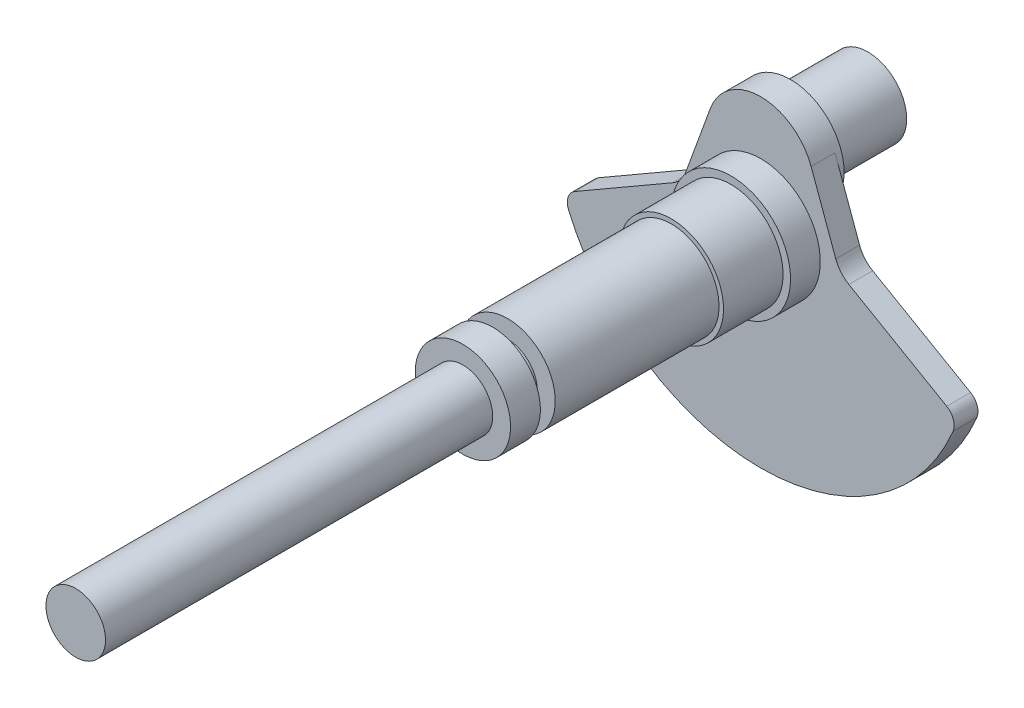
ISO-10303-21;
HEADER;
FILE_DESCRIPTION(('STEP AP214'),'2;1');
FILE_NAME('part.step','',(''),(''),'','','');
FILE_SCHEMA(('AUTOMOTIVE_DESIGN { 1 0 10303 214 1 1 1 1 }'));
ENDSEC;
DATA;
#1=APPLICATION_CONTEXT('core data for automotive mechanical design processes');
#2=APPLICATION_PROTOCOL_DEFINITION('international standard','automotive_design',2000,#1);
#3=PRODUCT_CONTEXT('',#1,'mechanical');
#4=PRODUCT('Part','Part','',(#3));
#5=PRODUCT_RELATED_PRODUCT_CATEGORY('part','',(#4));
#6=PRODUCT_DEFINITION_FORMATION('','',#4);
#7=PRODUCT_DEFINITION_CONTEXT('part definition',#1,'design');
#8=PRODUCT_DEFINITION('design','',#6,#7);
#9=PRODUCT_DEFINITION_SHAPE('','',#8);
#10=(LENGTH_UNIT() NAMED_UNIT(*) SI_UNIT(.MILLI.,.METRE.));
#11=(NAMED_UNIT(*) PLANE_ANGLE_UNIT() SI_UNIT($,.RADIAN.));
#12=(NAMED_UNIT(*) SI_UNIT($,.STERADIAN.) SOLID_ANGLE_UNIT());
#13=UNCERTAINTY_MEASURE_WITH_UNIT(LENGTH_MEASURE(1.E-05),#10,'distance_accuracy_value','');
#14=(GEOMETRIC_REPRESENTATION_CONTEXT(3) GLOBAL_UNCERTAINTY_ASSIGNED_CONTEXT((#13)) GLOBAL_UNIT_ASSIGNED_CONTEXT((#10,
#11,#12)) REPRESENTATION_CONTEXT('',''));
#15=CARTESIAN_POINT('',(0.,0.,0.));
#16=DIRECTION('',(0.,0.,1.));
#17=DIRECTION('',(1.,0.,0.));
#18=AXIS2_PLACEMENT_3D('',#15,#16,#17);
#19=CARTESIAN_POINT('',(0.,0.,-130.));
#20=DIRECTION('',(0.,0.,1.));
#21=DIRECTION('',(1.,0.,0.));
#22=AXIS2_PLACEMENT_3D('',#19,#20,#21);
#23=CYLINDRICAL_SURFACE('',#22,10.);
#24=CARTESIAN_POINT('',(0.,0.,-130.));
#25=DIRECTION('',(0.,0.,1.));
#26=DIRECTION('',(1.,0.,0.));
#27=AXIS2_PLACEMENT_3D('',#24,#25,#26);
#28=CIRCLE('',#27,10.);
#29=CARTESIAN_POINT('',(10.,0.,-130.));
#30=VERTEX_POINT('',#29);
#31=EDGE_CURVE('E231',#30,#30,#28,.T.);
#32=ORIENTED_EDGE('',*,*,#31,.T.);
#33=EDGE_LOOP('',(#32));
#34=FACE_BOUND('',#33,.T.);
#35=CARTESIAN_POINT('',(0.,0.,0.));
#36=DIRECTION('',(0.,0.,1.));
#37=DIRECTION('',(1.,0.,0.));
#38=AXIS2_PLACEMENT_3D('',#35,#36,#37);
#39=CIRCLE('',#38,10.);
#40=CARTESIAN_POINT('',(10.,0.,0.));
#41=VERTEX_POINT('',#40);
#42=EDGE_CURVE('E37',#41,#41,#39,.T.);
#43=ORIENTED_EDGE('',*,*,#42,.F.);
#44=EDGE_LOOP('',(#43));
#45=FACE_BOUND('',#44,.T.);
#46=ADVANCED_FACE('F34',(#34,#45),#23,.T.);
#47=CARTESIAN_POINT('',(0.,0.,0.));
#48=DIRECTION('',(0.,0.,1.));
#49=DIRECTION('',(1.,0.,0.));
#50=AXIS2_PLACEMENT_3D('',#47,#48,#49);
#51=PLANE('',#50);
#52=ORIENTED_EDGE('',*,*,#42,.T.);
#53=EDGE_LOOP('',(#52));
#54=FACE_BOUND('',#53,.T.);
#55=ADVANCED_FACE('F239',(#54),#51,.T.);
#56=CARTESIAN_POINT('',(0.,0.,-140.));
#57=DIRECTION('',(0.,0.,1.));
#58=DIRECTION('',(1.,0.,0.));
#59=AXIS2_PLACEMENT_3D('',#56,#57,#58);
#60=CYLINDRICAL_SURFACE('',#59,16.);
#61=CARTESIAN_POINT('',(0.,0.,-140.));
#62=DIRECTION('',(0.,0.,-1.));
#63=DIRECTION('',(-1.,0.,0.));
#64=AXIS2_PLACEMENT_3D('',#61,#62,#63);
#65=CIRCLE('',#64,16.);
#66=CARTESIAN_POINT('',(-16.,0.,-140.));
#67=VERTEX_POINT('',#66);
#68=EDGE_CURVE('E228',#67,#67,#65,.T.);
#69=ORIENTED_EDGE('',*,*,#68,.F.);
#70=EDGE_LOOP('',(#69));
#71=FACE_BOUND('',#70,.T.);
#72=CARTESIAN_POINT('',(0.,0.,-130.));
#73=DIRECTION('',(0.,0.,-1.));
#74=DIRECTION('',(-1.,0.,0.));
#75=AXIS2_PLACEMENT_3D('',#72,#73,#74);
#76=CIRCLE('',#75,16.);
#77=CARTESIAN_POINT('',(-16.,0.,-130.));
#78=VERTEX_POINT('',#77);
#79=EDGE_CURVE('E225',#78,#78,#76,.T.);
#80=ORIENTED_EDGE('',*,*,#79,.T.);
#81=EDGE_LOOP('',(#80));
#82=FACE_BOUND('',#81,.T.);
#83=ADVANCED_FACE('F245',(#71,#82),#60,.T.);
#84=CARTESIAN_POINT('',(0.,0.,-140.));
#85=DIRECTION('',(0.,0.,-1.));
#86=DIRECTION('',(-1.,0.,0.));
#87=AXIS2_PLACEMENT_3D('',#84,#85,#86);
#88=PLANE('',#87);
#89=CARTESIAN_POINT('',(0.,0.,-140.));
#90=DIRECTION('',(0.,0.,-1.));
#91=DIRECTION('',(-1.,0.,0.));
#92=AXIS2_PLACEMENT_3D('',#89,#90,#91);
#93=CIRCLE('',#92,10.);
#94=CARTESIAN_POINT('',(-10.,0.,-140.));
#95=VERTEX_POINT('',#94);
#96=EDGE_CURVE('E42',#95,#95,#93,.T.);
#97=ORIENTED_EDGE('',*,*,#96,.F.);
#98=EDGE_LOOP('',(#97));
#99=FACE_BOUND('',#98,.T.);
#100=ORIENTED_EDGE('',*,*,#68,.T.);
#101=EDGE_LOOP('',(#100));
#102=FACE_BOUND('',#101,.T.);
#103=ADVANCED_FACE('F249',(#99,#102),#88,.T.);
#104=CARTESIAN_POINT('',(0.,0.,-130.));
#105=DIRECTION('',(0.,0.,-1.));
#106=DIRECTION('',(-1.,0.,0.));
#107=AXIS2_PLACEMENT_3D('',#104,#105,#106);
#108=PLANE('',#107);
#109=ORIENTED_EDGE('',*,*,#31,.F.);
#110=EDGE_LOOP('',(#109));
#111=FACE_BOUND('',#110,.T.);
#112=ORIENTED_EDGE('',*,*,#79,.F.);
#113=EDGE_LOOP('',(#112));
#114=FACE_BOUND('',#113,.T.);
#115=ADVANCED_FACE('F253',(#111,#114),#108,.F.);
#116=CARTESIAN_POINT('',(0.,0.,-145.));
#117=DIRECTION('',(0.,0.,1.));
#118=DIRECTION('',(1.,0.,0.));
#119=AXIS2_PLACEMENT_3D('',#116,#117,#118);
#120=CYLINDRICAL_SURFACE('',#119,10.);
#121=CARTESIAN_POINT('',(0.,0.,-145.));
#122=DIRECTION('',(0.,0.,-1.));
#123=DIRECTION('',(-1.,0.,0.));
#124=AXIS2_PLACEMENT_3D('',#121,#122,#123);
#125=CIRCLE('',#124,10.);
#126=CARTESIAN_POINT('',(-10.,0.,-145.));
#127=VERTEX_POINT('',#126);
#128=EDGE_CURVE('E220',#127,#127,#125,.T.);
#129=ORIENTED_EDGE('',*,*,#128,.F.);
#130=EDGE_LOOP('',(#129));
#131=FACE_BOUND('',#130,.T.);
#132=ORIENTED_EDGE('',*,*,#96,.T.);
#133=EDGE_LOOP('',(#132));
#134=FACE_BOUND('',#133,.T.);
#135=ADVANCED_FACE('F256',(#131,#134),#120,.T.);
#136=CARTESIAN_POINT('',(0.,0.,-200.));
#137=DIRECTION('',(0.,0.,1.));
#138=DIRECTION('',(1.,0.,0.));
#139=AXIS2_PLACEMENT_3D('',#136,#137,#138);
#140=CYLINDRICAL_SURFACE('',#139,16.);
#141=CARTESIAN_POINT('',(0.,0.,-200.));
#142=DIRECTION('',(0.,0.,-1.));
#143=DIRECTION('',(-1.,0.,0.));
#144=AXIS2_PLACEMENT_3D('',#141,#142,#143);
#145=CIRCLE('',#144,16.);
#146=CARTESIAN_POINT('',(-16.,0.,-200.));
#147=VERTEX_POINT('',#146);
#148=EDGE_CURVE('E217',#147,#147,#145,.T.);
#149=ORIENTED_EDGE('',*,*,#148,.F.);
#150=EDGE_LOOP('',(#149));
#151=FACE_BOUND('',#150,.T.);
#152=CARTESIAN_POINT('',(0.,0.,-145.));
#153=DIRECTION('',(0.,0.,-1.));
#154=DIRECTION('',(-1.,0.,0.));
#155=AXIS2_PLACEMENT_3D('',#152,#153,#154);
#156=CIRCLE('',#155,16.);
#157=CARTESIAN_POINT('',(-16.,0.,-145.));
#158=VERTEX_POINT('',#157);
#159=EDGE_CURVE('E214',#158,#158,#156,.T.);
#160=ORIENTED_EDGE('',*,*,#159,.T.);
#161=EDGE_LOOP('',(#160));
#162=FACE_BOUND('',#161,.T.);
#163=ADVANCED_FACE('F263',(#151,#162),#140,.T.);
#164=CARTESIAN_POINT('',(0.,0.,-145.));
#165=DIRECTION('',(0.,0.,-1.));
#166=DIRECTION('',(-1.,0.,0.));
#167=AXIS2_PLACEMENT_3D('',#164,#165,#166);
#168=PLANE('',#167);
#169=ORIENTED_EDGE('',*,*,#128,.T.);
#170=EDGE_LOOP('',(#169));
#171=FACE_BOUND('',#170,.T.);
#172=ORIENTED_EDGE('',*,*,#159,.F.);
#173=EDGE_LOOP('',(#172));
#174=FACE_BOUND('',#173,.T.);
#175=ADVANCED_FACE('F267',(#171,#174),#168,.F.);
#176=CARTESIAN_POINT('',(0.,0.,-220.));
#177=DIRECTION('',(0.,0.,1.));
#178=DIRECTION('',(1.,0.,0.));
#179=AXIS2_PLACEMENT_3D('',#176,#177,#178);
#180=CYLINDRICAL_SURFACE('',#179,17.5);
#181=CARTESIAN_POINT('',(0.,0.,-220.));
#182=DIRECTION('',(0.,0.,-1.));
#183=DIRECTION('',(-1.,0.,0.));
#184=AXIS2_PLACEMENT_3D('',#181,#182,#183);
#185=CIRCLE('',#184,17.5);
#186=CARTESIAN_POINT('',(-17.5,0.,-220.));
#187=VERTEX_POINT('',#186);
#188=EDGE_CURVE('E211',#187,#187,#185,.T.);
#189=ORIENTED_EDGE('',*,*,#188,.F.);
#190=EDGE_LOOP('',(#189));
#191=FACE_BOUND('',#190,.T.);
#192=CARTESIAN_POINT('',(0.,0.,-200.));
#193=DIRECTION('',(0.,0.,-1.));
#194=DIRECTION('',(-1.,0.,0.));
#195=AXIS2_PLACEMENT_3D('',#192,#193,#194);
#196=CIRCLE('',#195,17.5);
#197=CARTESIAN_POINT('',(-17.5,0.,-200.));
#198=VERTEX_POINT('',#197);
#199=EDGE_CURVE('E208',#198,#198,#196,.T.);
#200=ORIENTED_EDGE('',*,*,#199,.T.);
#201=EDGE_LOOP('',(#200));
#202=FACE_BOUND('',#201,.T.);
#203=ADVANCED_FACE('F271',(#191,#202),#180,.T.);
#204=CARTESIAN_POINT('',(0.,0.,-200.));
#205=DIRECTION('',(0.,0.,-1.));
#206=DIRECTION('',(-1.,0.,0.));
#207=AXIS2_PLACEMENT_3D('',#204,#205,#206);
#208=PLANE('',#207);
#209=ORIENTED_EDGE('',*,*,#148,.T.);
#210=EDGE_LOOP('',(#209));
#211=FACE_BOUND('',#210,.T.);
#212=ORIENTED_EDGE('',*,*,#199,.F.);
#213=EDGE_LOOP('',(#212));
#214=FACE_BOUND('',#213,.T.);
#215=ADVANCED_FACE('F275',(#211,#214),#208,.F.);
#216=CARTESIAN_POINT('',(0.,0.,-230.));
#217=DIRECTION('',(0.,0.,1.));
#218=DIRECTION('',(1.,0.,0.));
#219=AXIS2_PLACEMENT_3D('',#216,#217,#218);
#220=CYLINDRICAL_SURFACE('',#219,20.);
#221=CARTESIAN_POINT('',(0.,0.,-230.));
#222=DIRECTION('',(0.,0.,-1.));
#223=DIRECTION('',(-1.,0.,0.));
#224=AXIS2_PLACEMENT_3D('',#221,#222,#223);
#225=CIRCLE('',#224,20.);
#226=CARTESIAN_POINT('',(-20.,0.,-230.));
#227=VERTEX_POINT('',#226);
#228=EDGE_CURVE('E205',#227,#227,#225,.T.);
#229=ORIENTED_EDGE('',*,*,#228,.F.);
#230=EDGE_LOOP('',(#229));
#231=FACE_BOUND('',#230,.T.);
#232=CARTESIAN_POINT('',(0.,0.,-220.));
#233=DIRECTION('',(0.,0.,-1.));
#234=DIRECTION('',(-1.,0.,0.));
#235=AXIS2_PLACEMENT_3D('',#232,#233,#234);
#236=CIRCLE('',#235,20.);
#237=CARTESIAN_POINT('',(-20.,0.,-220.));
#238=VERTEX_POINT('',#237);
#239=EDGE_CURVE('E203',#238,#238,#236,.T.);
#240=ORIENTED_EDGE('',*,*,#239,.T.);
#241=EDGE_LOOP('',(#240));
#242=FACE_BOUND('',#241,.T.);
#243=ADVANCED_FACE('F279',(#231,#242),#220,.T.);
#244=CARTESIAN_POINT('',(0.,0.,-220.));
#245=DIRECTION('',(0.,0.,-1.));
#246=DIRECTION('',(-1.,0.,0.));
#247=AXIS2_PLACEMENT_3D('',#244,#245,#246);
#248=PLANE('',#247);
#249=ORIENTED_EDGE('',*,*,#188,.T.);
#250=EDGE_LOOP('',(#249));
#251=FACE_BOUND('',#250,.T.);
#252=ORIENTED_EDGE('',*,*,#239,.F.);
#253=EDGE_LOOP('',(#252));
#254=FACE_BOUND('',#253,.T.);
#255=ADVANCED_FACE('F283',(#251,#254),#248,.F.);
#256=CARTESIAN_POINT('',(0.,0.,-230.));
#257=DIRECTION('',(0.,0.,-1.));
#258=DIRECTION('',(-1.,0.,0.));
#259=AXIS2_PLACEMENT_3D('',#256,#257,#258);
#260=PLANE('',#259);
#261=ORIENTED_EDGE('',*,*,#228,.T.);
#262=EDGE_LOOP('',(#261));
#263=FACE_BOUND('',#262,.T.);
#264=CARTESIAN_POINT('',(0.,20.,-230.));
#265=DIRECTION('',(0.,0.,-1.));
#266=DIRECTION('',(-1.,0.,0.));
#267=AXIS2_PLACEMENT_3D('',#264,#265,#266);
#268=CIRCLE('',#267,18.);
#269=CARTESIAN_POINT('',(-16.9144671741462,26.1563625798624,-230.));
#270=VERTEX_POINT('',#269);
#271=CARTESIAN_POINT('',(16.9144671741463,26.1563625798621,-230.));
#272=VERTEX_POINT('',#271);
#273=EDGE_CURVE('E198',#270,#272,#268,.T.);
#274=ORIENTED_EDGE('',*,*,#273,.F.);
#275=DIRECTION('',(-0.342020143325669,-0.939692620785908,0.));
#276=VECTOR('',#275,1.);
#277=CARTESIAN_POINT('',(-16.9144671741462,26.1563625798624,-230.));
#278=LINE('',#277,#276);
#279=CARTESIAN_POINT('',(-25.1897530729904,3.42020143325679,-230.));
#280=VERTEX_POINT('',#279);
#281=EDGE_CURVE('E170',#270,#280,#278,.T.);
#282=ORIENTED_EDGE('',*,*,#281,.T.);
#283=CARTESIAN_POINT('',(-34.5866792808495,6.84040286651341,-230.));
#284=DIRECTION('',(0.,0.,-1.));
#285=DIRECTION('',(-1.,0.,0.));
#286=AXIS2_PLACEMENT_3D('',#283,#284,#285);
#287=CIRCLE('',#286,9.99999999999997);
#288=CARTESIAN_POINT('',(-29.5866792808495,-1.81985117133095,-230.));
#289=VERTEX_POINT('',#288);
#290=EDGE_CURVE('E173',#280,#289,#287,.T.);
#291=ORIENTED_EDGE('',*,*,#290,.T.);
#292=DIRECTION('',(-0.866025403784441,-0.499999999999995,0.));
#293=VECTOR('',#292,1.);
#294=CARTESIAN_POINT('',(-29.5866792808495,-1.81985117133093,-230.));
#295=LINE('',#294,#293);
#296=CARTESIAN_POINT('',(-62.4486633004542,-20.7927264911546,-230.));
#297=VERTEX_POINT('',#296);
#298=EDGE_CURVE('E176',#289,#297,#295,.T.);
#299=ORIENTED_EDGE('',*,*,#298,.T.);
#300=CARTESIAN_POINT('',(-59.9486633004542,-25.1228535100766,-230.));
#301=DIRECTION('',(0.,0.,1.));
#302=DIRECTION('',(-1.,0.,0.));
#303=AXIS2_PLACEMENT_3D('',#300,#301,#302);
#304=CIRCLE('',#303,4.99999999999993);
#305=CARTESIAN_POINT('',(-64.5600989389506,-27.0553807031596,-230.));
#306=VERTEX_POINT('',#305);
#307=EDGE_CURVE('E140',#297,#306,#304,.T.);
#308=ORIENTED_EDGE('',*,*,#307,.T.);
#309=CARTESIAN_POINT('',(0.,0.,-230.));
#310=DIRECTION('',(0.,0.,1.));
#311=DIRECTION('',(1.,0.,0.));
#312=AXIS2_PLACEMENT_3D('',#309,#310,#311);
#313=CIRCLE('',#312,70.);
#314=CARTESIAN_POINT('',(64.5600989389506,-27.0553807031597,-230.));
#315=VERTEX_POINT('',#314);
#316=EDGE_CURVE('E137',#306,#315,#313,.T.);
#317=ORIENTED_EDGE('',*,*,#316,.T.);
#318=CARTESIAN_POINT('',(59.9486633004542,-25.1228535100768,-230.));
#319=DIRECTION('',(0.,0.,1.));
#320=DIRECTION('',(-1.,0.,0.));
#321=AXIS2_PLACEMENT_3D('',#318,#319,#320);
#322=CIRCLE('',#321,5.);
#323=CARTESIAN_POINT('',(62.4486633004542,-20.7927264911546,-230.));
#324=VERTEX_POINT('',#323);
#325=EDGE_CURVE('E161',#315,#324,#322,.T.);
#326=ORIENTED_EDGE('',*,*,#325,.T.);
#327=DIRECTION('',(-0.866025403784441,0.499999999999996,0.));
#328=VECTOR('',#327,1.);
#329=CARTESIAN_POINT('',(29.5866792808495,-1.81985117133092,-230.));
#330=LINE('',#329,#328);
#331=CARTESIAN_POINT('',(29.5866792808495,-1.81985117133092,-230.));
#332=VERTEX_POINT('',#331);
#333=EDGE_CURVE('E116',#324,#332,#330,.T.);
#334=ORIENTED_EDGE('',*,*,#333,.T.);
#335=CARTESIAN_POINT('',(34.5866792808495,6.84040286651341,-230.));
#336=DIRECTION('',(0.,0.,-1.));
#337=DIRECTION('',(1.,0.,0.));
#338=AXIS2_PLACEMENT_3D('',#335,#336,#337);
#339=CIRCLE('',#338,9.99999999999997);
#340=CARTESIAN_POINT('',(25.1897530729904,3.42020143325678,-230.));
#341=VERTEX_POINT('',#340);
#342=EDGE_CURVE('E164',#332,#341,#339,.T.);
#343=ORIENTED_EDGE('',*,*,#342,.T.);
#344=DIRECTION('',(-0.34202014332567,0.939692620785908,0.));
#345=VECTOR('',#344,1.);
#346=CARTESIAN_POINT('',(16.9144671741463,26.156362579862,-230.));
#347=LINE('',#346,#345);
#348=EDGE_CURVE('E167',#341,#272,#347,.T.);
#349=ORIENTED_EDGE('',*,*,#348,.T.);
#350=EDGE_LOOP('',(#274,#282,#291,#299,#308,#317,#326,#334,#343,#349));
#351=FACE_BOUND('',#350,.T.);
#352=ADVANCED_FACE('F287',(#263,#351),#260,.F.);
#353=CARTESIAN_POINT('',(0.,20.,-240.));
#354=DIRECTION('',(0.,0.,1.));
#355=DIRECTION('',(1.,0.,0.));
#356=AXIS2_PLACEMENT_3D('',#353,#354,#355);
#357=CYLINDRICAL_SURFACE('',#356,18.);
#358=CARTESIAN_POINT('',(0.,20.,-238.));
#359=DIRECTION('',(0.,0.,-1.));
#360=DIRECTION('',(1.,0.,0.));
#361=AXIS2_PLACEMENT_3D('',#358,#359,#360);
#362=CIRCLE('',#361,18.);
#363=CARTESIAN_POINT('',(16.9144671741463,26.1563625798621,-238.));
#364=VERTEX_POINT('',#363);
#365=CARTESIAN_POINT('',(-16.9144671741464,26.1563625798621,-238.));
#366=VERTEX_POINT('',#365);
#367=EDGE_CURVE('E50',#364,#366,#362,.T.);
#368=ORIENTED_EDGE('',*,*,#367,.T.);
#369=DIRECTION('',(0.,0.,1.));
#370=VECTOR('',#369,1.);
#371=CARTESIAN_POINT('',(-16.9144671741462,26.1563625798624,-238.));
#372=LINE('',#371,#370);
#373=EDGE_CURVE('E191',#366,#270,#372,.T.);
#374=ORIENTED_EDGE('',*,*,#373,.T.);
#375=ORIENTED_EDGE('',*,*,#273,.T.);
#376=DIRECTION('',(0.,0.,1.));
#377=VECTOR('',#376,1.);
#378=CARTESIAN_POINT('',(16.9144671741463,26.156362579862,-238.));
#379=LINE('',#378,#377);
#380=EDGE_CURVE('E55',#364,#272,#379,.T.);
#381=ORIENTED_EDGE('',*,*,#380,.F.);
#382=EDGE_LOOP('',(#368,#374,#375,#381));
#383=FACE_BOUND('',#382,.T.);
#384=CARTESIAN_POINT('',(0.,20.,-240.));
#385=DIRECTION('',(0.,0.,-1.));
#386=DIRECTION('',(-1.,0.,0.));
#387=AXIS2_PLACEMENT_3D('',#384,#385,#386);
#388=CIRCLE('',#387,18.);
#389=CARTESIAN_POINT('',(-18.,20.,-240.));
#390=VERTEX_POINT('',#389);
#391=EDGE_CURVE('E200',#390,#390,#388,.T.);
#392=ORIENTED_EDGE('',*,*,#391,.F.);
#393=EDGE_LOOP('',(#392));
#394=FACE_BOUND('',#393,.T.);
#395=ADVANCED_FACE('F289',(#383,#394),#357,.T.);
#396=CARTESIAN_POINT('',(0.,0.,-240.));
#397=DIRECTION('',(0.,0.,-1.));
#398=DIRECTION('',(-1.,0.,0.));
#399=AXIS2_PLACEMENT_3D('',#396,#397,#398);
#400=PLANE('',#399);
#401=CARTESIAN_POINT('',(0.,20.,-240.));
#402=DIRECTION('',(0.,0.,-1.));
#403=DIRECTION('',(-1.,0.,0.));
#404=AXIS2_PLACEMENT_3D('',#401,#402,#403);
#405=CIRCLE('',#404,13.);
#406=CARTESIAN_POINT('',(-13.,20.,-240.));
#407=VERTEX_POINT('',#406);
#408=EDGE_CURVE('E11',#407,#407,#405,.T.);
#409=ORIENTED_EDGE('',*,*,#408,.F.);
#410=EDGE_LOOP('',(#409));
#411=FACE_BOUND('',#410,.T.);
#412=ORIENTED_EDGE('',*,*,#391,.T.);
#413=EDGE_LOOP('',(#412));
#414=FACE_BOUND('',#413,.T.);
#415=ADVANCED_FACE('F292',(#411,#414),#400,.T.);
#416=CARTESIAN_POINT('',(0.,20.,-266.));
#417=DIRECTION('',(0.,0.,1.));
#418=DIRECTION('',(1.,0.,0.));
#419=AXIS2_PLACEMENT_3D('',#416,#417,#418);
#420=CYLINDRICAL_SURFACE('',#419,13.);
#421=CARTESIAN_POINT('',(0.,20.,-266.));
#422=DIRECTION('',(0.,0.,-1.));
#423=DIRECTION('',(-1.,0.,0.));
#424=AXIS2_PLACEMENT_3D('',#421,#422,#423);
#425=CIRCLE('',#424,13.);
#426=CARTESIAN_POINT('',(-13.,20.,-266.));
#427=VERTEX_POINT('',#426);
#428=EDGE_CURVE('E182',#427,#427,#425,.T.);
#429=ORIENTED_EDGE('',*,*,#428,.F.);
#430=EDGE_LOOP('',(#429));
#431=FACE_BOUND('',#430,.T.);
#432=ORIENTED_EDGE('',*,*,#408,.T.);
#433=EDGE_LOOP('',(#432));
#434=FACE_BOUND('',#433,.T.);
#435=ADVANCED_FACE('F298',(#431,#434),#420,.T.);
#436=CARTESIAN_POINT('',(0.,20.,-266.));
#437=DIRECTION('',(0.,0.,-1.));
#438=DIRECTION('',(-1.,0.,0.));
#439=AXIS2_PLACEMENT_3D('',#436,#437,#438);
#440=PLANE('',#439);
#441=ORIENTED_EDGE('',*,*,#428,.T.);
#442=EDGE_LOOP('',(#441));
#443=FACE_BOUND('',#442,.T.);
#444=ADVANCED_FACE('F302',(#443),#440,.T.);
#445=CARTESIAN_POINT('',(59.9486633004542,-25.1228535100768,-238.));
#446=DIRECTION('',(0.,0.,1.));
#447=DIRECTION('',(1.,0.,0.));
#448=AXIS2_PLACEMENT_3D('',#445,#446,#447);
#449=CYLINDRICAL_SURFACE('',#448,5.);
#450=ORIENTED_EDGE('',*,*,#325,.F.);
#451=DIRECTION('',(0.,0.,1.));
#452=VECTOR('',#451,1.);
#453=CARTESIAN_POINT('',(64.5600989389506,-27.0553807031597,-238.));
#454=LINE('',#453,#452);
#455=CARTESIAN_POINT('',(64.5600989389506,-27.0553807031597,-238.));
#456=VERTEX_POINT('',#455);
#457=EDGE_CURVE('E136',#456,#315,#454,.T.);
#458=ORIENTED_EDGE('',*,*,#457,.F.);
#459=CARTESIAN_POINT('',(59.9486633004542,-25.1228535100768,-238.));
#460=DIRECTION('',(0.,0.,1.));
#461=DIRECTION('',(-1.,0.,0.));
#462=AXIS2_PLACEMENT_3D('',#459,#460,#461);
#463=CIRCLE('',#462,5.);
#464=CARTESIAN_POINT('',(62.4486633004542,-20.7927264911546,-238.));
#465=VERTEX_POINT('',#464);
#466=EDGE_CURVE('E129',#456,#465,#463,.T.);
#467=ORIENTED_EDGE('',*,*,#466,.T.);
#468=DIRECTION('',(0.,0.,1.));
#469=VECTOR('',#468,1.);
#470=CARTESIAN_POINT('',(62.4486633004542,-20.7927264911546,-238.));
#471=LINE('',#470,#469);
#472=EDGE_CURVE('E111',#465,#324,#471,.T.);
#473=ORIENTED_EDGE('',*,*,#472,.T.);
#474=EDGE_LOOP('',(#450,#458,#467,#473));
#475=FACE_BOUND('',#474,.T.);
#476=ADVANCED_FACE('F135',(#475),#449,.T.);
#477=CARTESIAN_POINT('',(0.,0.,-238.));
#478=DIRECTION('',(0.,0.,1.));
#479=DIRECTION('',(1.,0.,0.));
#480=AXIS2_PLACEMENT_3D('',#477,#478,#479);
#481=CYLINDRICAL_SURFACE('',#480,70.);
#482=ORIENTED_EDGE('',*,*,#316,.F.);
#483=DIRECTION('',(0.,0.,1.));
#484=VECTOR('',#483,1.);
#485=CARTESIAN_POINT('',(-64.5600989389506,-27.0553807031596,-238.));
#486=LINE('',#485,#484);
#487=CARTESIAN_POINT('',(-64.5600989389506,-27.0553807031596,-238.));
#488=VERTEX_POINT('',#487);
#489=EDGE_CURVE('E183',#488,#306,#486,.T.);
#490=ORIENTED_EDGE('',*,*,#489,.F.);
#491=CARTESIAN_POINT('',(0.,0.,-238.));
#492=DIRECTION('',(0.,0.,1.));
#493=DIRECTION('',(1.,0.,0.));
#494=AXIS2_PLACEMENT_3D('',#491,#492,#493);
#495=CIRCLE('',#494,70.);
#496=EDGE_CURVE('E122',#488,#456,#495,.T.);
#497=ORIENTED_EDGE('',*,*,#496,.T.);
#498=ORIENTED_EDGE('',*,*,#457,.T.);
#499=EDGE_LOOP('',(#482,#490,#497,#498));
#500=FACE_BOUND('',#499,.T.);
#501=ADVANCED_FACE('F309',(#500),#481,.T.);
#502=CARTESIAN_POINT('',(-59.9486633004542,-25.1228535100766,-238.));
#503=DIRECTION('',(0.,0.,1.));
#504=DIRECTION('',(1.,0.,0.));
#505=AXIS2_PLACEMENT_3D('',#502,#503,#504);
#506=CYLINDRICAL_SURFACE('',#505,4.99999999999993);
#507=ORIENTED_EDGE('',*,*,#307,.F.);
#508=DIRECTION('',(0.,0.,1.));
#509=VECTOR('',#508,1.);
#510=CARTESIAN_POINT('',(-62.4486633004542,-20.7927264911546,-238.));
#511=LINE('',#510,#509);
#512=CARTESIAN_POINT('',(-62.4486633004542,-20.7927264911546,-238.));
#513=VERTEX_POINT('',#512);
#514=EDGE_CURVE('E185',#513,#297,#511,.T.);
#515=ORIENTED_EDGE('',*,*,#514,.F.);
#516=CARTESIAN_POINT('',(-59.9486633004542,-25.1228535100766,-238.));
#517=DIRECTION('',(0.,0.,1.));
#518=DIRECTION('',(-1.,0.,0.));
#519=AXIS2_PLACEMENT_3D('',#516,#517,#518);
#520=CIRCLE('',#519,4.99999999999993);
#521=EDGE_CURVE('E157',#513,#488,#520,.T.);
#522=ORIENTED_EDGE('',*,*,#521,.T.);
#523=ORIENTED_EDGE('',*,*,#489,.T.);
#524=EDGE_LOOP('',(#507,#515,#522,#523));
#525=FACE_BOUND('',#524,.T.);
#526=ADVANCED_FACE('F331',(#525),#506,.T.);
#527=CARTESIAN_POINT('',(-29.5866792808495,-1.81985117133093,-238.));
#528=DIRECTION('',(-0.499999999999995,0.866025403784441,0.));
#529=DIRECTION('',(-0.866025403784442,-0.499999999999995,0.));
#530=AXIS2_PLACEMENT_3D('',#527,#528,#529);
#531=PLANE('',#530);
#532=ORIENTED_EDGE('',*,*,#298,.F.);
#533=DIRECTION('',(0.,0.,1.));
#534=VECTOR('',#533,1.);
#535=CARTESIAN_POINT('',(-29.5866792808495,-1.81985117133095,-238.));
#536=LINE('',#535,#534);
#537=CARTESIAN_POINT('',(-29.5866792808495,-1.81985117133095,-238.));
#538=VERTEX_POINT('',#537);
#539=EDGE_CURVE('E187',#538,#289,#536,.T.);
#540=ORIENTED_EDGE('',*,*,#539,.F.);
#541=DIRECTION('',(-0.866025403784441,-0.499999999999995,0.));
#542=VECTOR('',#541,1.);
#543=CARTESIAN_POINT('',(-29.5866792808495,-1.81985117133093,-238.));
#544=LINE('',#543,#542);
#545=EDGE_CURVE('E154',#538,#513,#544,.T.);
#546=ORIENTED_EDGE('',*,*,#545,.T.);
#547=ORIENTED_EDGE('',*,*,#514,.T.);
#548=EDGE_LOOP('',(#532,#540,#546,#547));
#549=FACE_BOUND('',#548,.T.);
#550=ADVANCED_FACE('F327',(#549),#531,.T.);
#551=CARTESIAN_POINT('',(-34.5866792808495,6.84040286651341,-238.));
#552=DIRECTION('',(0.,0.,1.));
#553=DIRECTION('',(1.,0.,0.));
#554=AXIS2_PLACEMENT_3D('',#551,#552,#553);
#555=CYLINDRICAL_SURFACE('',#554,9.99999999999997);
#556=ORIENTED_EDGE('',*,*,#290,.F.);
#557=DIRECTION('',(0.,0.,1.));
#558=VECTOR('',#557,1.);
#559=CARTESIAN_POINT('',(-25.1897530729904,3.42020143325679,-238.));
#560=LINE('',#559,#558);
#561=CARTESIAN_POINT('',(-25.1897530729904,3.42020143325679,-238.));
#562=VERTEX_POINT('',#561);
#563=EDGE_CURVE('E189',#562,#280,#560,.T.);
#564=ORIENTED_EDGE('',*,*,#563,.F.);
#565=CARTESIAN_POINT('',(-34.5866792808495,6.84040286651341,-238.));
#566=DIRECTION('',(0.,0.,-1.));
#567=DIRECTION('',(-1.,0.,0.));
#568=AXIS2_PLACEMENT_3D('',#565,#566,#567);
#569=CIRCLE('',#568,9.99999999999997);
#570=EDGE_CURVE('E151',#562,#538,#569,.T.);
#571=ORIENTED_EDGE('',*,*,#570,.T.);
#572=ORIENTED_EDGE('',*,*,#539,.T.);
#573=EDGE_LOOP('',(#556,#564,#571,#572));
#574=FACE_BOUND('',#573,.T.);
#575=ADVANCED_FACE('F323',(#574),#555,.F.);
#576=CARTESIAN_POINT('',(-16.9144671741462,26.1563625798624,-238.));
#577=DIRECTION('',(-0.939692620785908,0.342020143325669,0.));
#578=DIRECTION('',(-0.342020143325669,-0.939692620785908,0.));
#579=AXIS2_PLACEMENT_3D('',#576,#577,#578);
#580=PLANE('',#579);
#581=ORIENTED_EDGE('',*,*,#281,.F.);
#582=ORIENTED_EDGE('',*,*,#373,.F.);
#583=DIRECTION('',(-0.342020143325669,-0.939692620785908,0.));
#584=VECTOR('',#583,1.);
#585=CARTESIAN_POINT('',(-16.9144671741462,26.1563625798624,-238.));
#586=LINE('',#585,#584);
#587=EDGE_CURVE('E148',#366,#562,#586,.T.);
#588=ORIENTED_EDGE('',*,*,#587,.T.);
#589=ORIENTED_EDGE('',*,*,#563,.T.);
#590=EDGE_LOOP('',(#581,#582,#588,#589));
#591=FACE_BOUND('',#590,.T.);
#592=ADVANCED_FACE('F319',(#591),#580,.T.);
#593=CARTESIAN_POINT('',(16.9144671741463,26.156362579862,-238.));
#594=DIRECTION('',(0.939692620785908,0.34202014332567,0.));
#595=DIRECTION('',(-0.34202014332567,0.939692620785908,0.));
#596=AXIS2_PLACEMENT_3D('',#593,#594,#595);
#597=PLANE('',#596);
#598=ORIENTED_EDGE('',*,*,#348,.F.);
#599=DIRECTION('',(0.,0.,1.));
#600=VECTOR('',#599,1.);
#601=CARTESIAN_POINT('',(25.1897530729904,3.42020143325678,-238.));
#602=LINE('',#601,#600);
#603=CARTESIAN_POINT('',(25.1897530729904,3.42020143325678,-238.));
#604=VERTEX_POINT('',#603);
#605=EDGE_CURVE('E194',#604,#341,#602,.T.);
#606=ORIENTED_EDGE('',*,*,#605,.F.);
#607=DIRECTION('',(-0.34202014332567,0.939692620785908,0.));
#608=VECTOR('',#607,1.);
#609=CARTESIAN_POINT('',(16.9144671741463,26.156362579862,-238.));
#610=LINE('',#609,#608);
#611=EDGE_CURVE('E144',#604,#364,#610,.T.);
#612=ORIENTED_EDGE('',*,*,#611,.T.);
#613=ORIENTED_EDGE('',*,*,#380,.T.);
#614=EDGE_LOOP('',(#598,#606,#612,#613));
#615=FACE_BOUND('',#614,.T.);
#616=ADVANCED_FACE('F315',(#615),#597,.T.);
#617=CARTESIAN_POINT('',(34.5866792808495,6.84040286651341,-238.));
#618=DIRECTION('',(0.,0.,1.));
#619=DIRECTION('',(1.,0.,0.));
#620=AXIS2_PLACEMENT_3D('',#617,#618,#619);
#621=CYLINDRICAL_SURFACE('',#620,9.99999999999997);
#622=ORIENTED_EDGE('',*,*,#342,.F.);
#623=DIRECTION('',(0.,0.,1.));
#624=VECTOR('',#623,1.);
#625=CARTESIAN_POINT('',(29.5866792808495,-1.81985117133092,-238.));
#626=LINE('',#625,#624);
#627=CARTESIAN_POINT('',(29.5866792808495,-1.81985117133092,-238.));
#628=VERTEX_POINT('',#627);
#629=EDGE_CURVE('E121',#628,#332,#626,.T.);
#630=ORIENTED_EDGE('',*,*,#629,.F.);
#631=CARTESIAN_POINT('',(34.5866792808495,6.84040286651341,-238.));
#632=DIRECTION('',(0.,0.,-1.));
#633=DIRECTION('',(1.,0.,0.));
#634=AXIS2_PLACEMENT_3D('',#631,#632,#633);
#635=CIRCLE('',#634,9.99999999999997);
#636=EDGE_CURVE('E133',#628,#604,#635,.T.);
#637=ORIENTED_EDGE('',*,*,#636,.T.);
#638=ORIENTED_EDGE('',*,*,#605,.T.);
#639=EDGE_LOOP('',(#622,#630,#637,#638));
#640=FACE_BOUND('',#639,.T.);
#641=ADVANCED_FACE('F312',(#640),#621,.F.);
#642=CARTESIAN_POINT('',(29.5866792808495,-1.81985117133092,-238.));
#643=DIRECTION('',(0.499999999999996,0.866025403784441,0.));
#644=DIRECTION('',(-0.866025403784441,0.499999999999996,0.));
#645=AXIS2_PLACEMENT_3D('',#642,#643,#644);
#646=PLANE('',#645);
#647=ORIENTED_EDGE('',*,*,#333,.F.);
#648=ORIENTED_EDGE('',*,*,#472,.F.);
#649=DIRECTION('',(-0.866025403784441,0.499999999999996,0.));
#650=VECTOR('',#649,1.);
#651=CARTESIAN_POINT('',(29.5866792808495,-1.81985117133092,-238.));
#652=LINE('',#651,#650);
#653=EDGE_CURVE('E114',#465,#628,#652,.T.);
#654=ORIENTED_EDGE('',*,*,#653,.T.);
#655=ORIENTED_EDGE('',*,*,#629,.T.);
#656=EDGE_LOOP('',(#647,#648,#654,#655));
#657=FACE_BOUND('',#656,.T.);
#658=ADVANCED_FACE('F113',(#657),#646,.T.);
#659=CARTESIAN_POINT('',(59.9486633004542,-25.1228535100768,-238.));
#660=DIRECTION('',(0.,0.,-1.));
#661=DIRECTION('',(-1.,0.,0.));
#662=AXIS2_PLACEMENT_3D('',#659,#660,#661);
#663=PLANE('',#662);
#664=ORIENTED_EDGE('',*,*,#466,.F.);
#665=ORIENTED_EDGE('',*,*,#496,.F.);
#666=ORIENTED_EDGE('',*,*,#521,.F.);
#667=ORIENTED_EDGE('',*,*,#545,.F.);
#668=ORIENTED_EDGE('',*,*,#570,.F.);
#669=ORIENTED_EDGE('',*,*,#587,.F.);
#670=ORIENTED_EDGE('',*,*,#367,.F.);
#671=ORIENTED_EDGE('',*,*,#611,.F.);
#672=ORIENTED_EDGE('',*,*,#636,.F.);
#673=ORIENTED_EDGE('',*,*,#653,.F.);
#674=EDGE_LOOP('',(#664,#665,#666,#667,#668,#669,#670,#671,#672,#673));
#675=FACE_BOUND('',#674,.T.);
#676=ADVANCED_FACE('F127',(#675),#663,.T.);
#677=CLOSED_SHELL('',(#46,#55,#83,#103,#115,#135,#163,#175,#203,#215,#243,#255,#352,#395,#415,
#435,#444,#476,#501,#526,#550,#575,#592,#616,#641,#658,#676));
#678=MANIFOLD_SOLID_BREP('B2',#677);
#679=ADVANCED_BREP_SHAPE_REPRESENTATION('',(#18,#678),#14);
#680=SHAPE_DEFINITION_REPRESENTATION(#9,#679);
ENDSEC;
END-ISO-10303-21;
